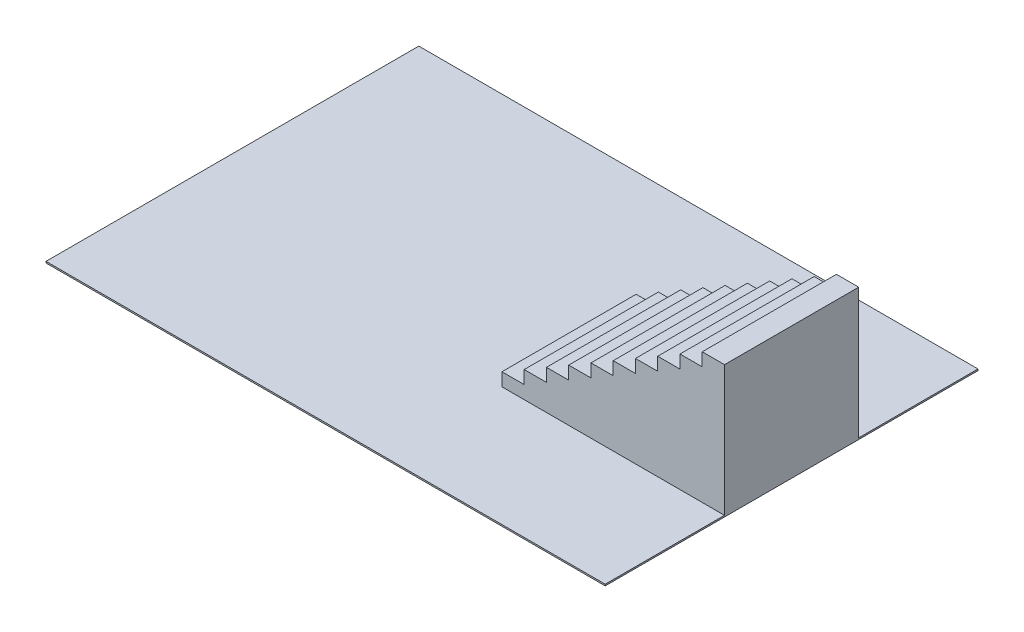
ISO-10303-21;
HEADER;
FILE_DESCRIPTION(('STEP AP214'),'2;1');
FILE_NAME('part.step','',(''),(''),'','','');
FILE_SCHEMA(('AUTOMOTIVE_DESIGN { 1 0 10303 214 1 1 1 1 }'));
ENDSEC;
DATA;
#1=APPLICATION_CONTEXT('core data for automotive mechanical design processes');
#2=APPLICATION_PROTOCOL_DEFINITION('international standard','automotive_design',2000,#1);
#3=PRODUCT_CONTEXT('',#1,'mechanical');
#4=PRODUCT('Part','Part','',(#3));
#5=PRODUCT_RELATED_PRODUCT_CATEGORY('part','',(#4));
#6=PRODUCT_DEFINITION_FORMATION('','',#4);
#7=PRODUCT_DEFINITION_CONTEXT('part definition',#1,'design');
#8=PRODUCT_DEFINITION('design','',#6,#7);
#9=PRODUCT_DEFINITION_SHAPE('','',#8);
#10=(LENGTH_UNIT() NAMED_UNIT(*) SI_UNIT(.MILLI.,.METRE.));
#11=(NAMED_UNIT(*) PLANE_ANGLE_UNIT() SI_UNIT($,.RADIAN.));
#12=(NAMED_UNIT(*) SI_UNIT($,.STERADIAN.) SOLID_ANGLE_UNIT());
#13=UNCERTAINTY_MEASURE_WITH_UNIT(LENGTH_MEASURE(1.E-05),#10,'distance_accuracy_value','');
#14=(GEOMETRIC_REPRESENTATION_CONTEXT(3) GLOBAL_UNCERTAINTY_ASSIGNED_CONTEXT((#13)) GLOBAL_UNIT_ASSIGNED_CONTEXT((#10,
#11,#12)) REPRESENTATION_CONTEXT('',''));
#15=CARTESIAN_POINT('',(0.,0.,0.));
#16=DIRECTION('',(0.,0.,1.));
#17=DIRECTION('',(1.,0.,0.));
#18=AXIS2_PLACEMENT_3D('',#15,#16,#17);
#19=CARTESIAN_POINT('',(-952.5,5.08,-635.));
#20=DIRECTION('',(1.,0.,0.));
#21=DIRECTION('',(0.,0.,-1.));
#22=AXIS2_PLACEMENT_3D('',#19,#20,#21);
#23=PLANE('',#22);
#24=DIRECTION('',(0.,0.,1.));
#25=VECTOR('',#24,1.);
#26=CARTESIAN_POINT('',(-952.5,0.,-635.));
#27=LINE('',#26,#25);
#28=CARTESIAN_POINT('',(-952.5,0.,-635.));
#29=VERTEX_POINT('',#28);
#30=CARTESIAN_POINT('',(-952.5,0.,635.));
#31=VERTEX_POINT('',#30);
#32=EDGE_CURVE('E244',#29,#31,#27,.T.);
#33=ORIENTED_EDGE('',*,*,#32,.T.);
#34=DIRECTION('',(0.,-1.,0.));
#35=VECTOR('',#34,1.);
#36=CARTESIAN_POINT('',(-952.5,5.08,635.));
#37=LINE('',#36,#35);
#38=CARTESIAN_POINT('',(-952.5,5.08,635.));
#39=VERTEX_POINT('',#38);
#40=EDGE_CURVE('E11',#39,#31,#37,.T.);
#41=ORIENTED_EDGE('',*,*,#40,.F.);
#42=DIRECTION('',(0.,0.,1.));
#43=VECTOR('',#42,1.);
#44=CARTESIAN_POINT('',(-952.5,5.08,-635.));
#45=LINE('',#44,#43);
#46=CARTESIAN_POINT('',(-952.5,5.08,-635.));
#47=VERTEX_POINT('',#46);
#48=EDGE_CURVE('E252',#47,#39,#45,.T.);
#49=ORIENTED_EDGE('',*,*,#48,.F.);
#50=DIRECTION('',(0.,-1.,0.));
#51=VECTOR('',#50,1.);
#52=CARTESIAN_POINT('',(-952.5,5.08,-635.));
#53=LINE('',#52,#51);
#54=EDGE_CURVE('E239',#47,#29,#53,.T.);
#55=ORIENTED_EDGE('',*,*,#54,.T.);
#56=EDGE_LOOP('',(#33,#41,#49,#55));
#57=FACE_BOUND('',#56,.T.);
#58=ADVANCED_FACE('F33',(#57),#23,.F.);
#59=CARTESIAN_POINT('',(952.5,5.08,635.));
#60=DIRECTION('',(0.,0.,-1.));
#61=DIRECTION('',(-1.,0.,0.));
#62=AXIS2_PLACEMENT_3D('',#59,#60,#61);
#63=PLANE('',#62);
#64=DIRECTION('',(1.,0.,0.));
#65=VECTOR('',#64,1.);
#66=CARTESIAN_POINT('',(952.5,0.,635.));
#67=LINE('',#66,#65);
#68=CARTESIAN_POINT('',(952.5,0.,635.));
#69=VERTEX_POINT('',#68);
#70=EDGE_CURVE('E247',#31,#69,#67,.T.);
#71=ORIENTED_EDGE('',*,*,#70,.T.);
#72=DIRECTION('',(0.,-1.,0.));
#73=VECTOR('',#72,1.);
#74=CARTESIAN_POINT('',(952.5,5.08,635.));
#75=LINE('',#74,#73);
#76=CARTESIAN_POINT('',(952.5,5.08,635.));
#77=VERTEX_POINT('',#76);
#78=EDGE_CURVE('E40',#77,#69,#75,.T.);
#79=ORIENTED_EDGE('',*,*,#78,.F.);
#80=DIRECTION('',(1.,0.,0.));
#81=VECTOR('',#80,1.);
#82=CARTESIAN_POINT('',(952.5,5.08,635.));
#83=LINE('',#82,#81);
#84=EDGE_CURVE('E84',#39,#77,#83,.T.);
#85=ORIENTED_EDGE('',*,*,#84,.F.);
#86=ORIENTED_EDGE('',*,*,#40,.T.);
#87=EDGE_LOOP('',(#71,#79,#85,#86));
#88=FACE_BOUND('',#87,.T.);
#89=ADVANCED_FACE('F511',(#88),#63,.F.);
#90=CARTESIAN_POINT('',(952.5,5.08,-635.));
#91=DIRECTION('',(-1.,0.,0.));
#92=DIRECTION('',(0.,0.,1.));
#93=AXIS2_PLACEMENT_3D('',#90,#91,#92);
#94=PLANE('',#93);
#95=DIRECTION('',(0.,0.,-1.));
#96=VECTOR('',#95,1.);
#97=CARTESIAN_POINT('',(952.5,0.,-635.));
#98=LINE('',#97,#96);
#99=CARTESIAN_POINT('',(952.5,0.,-635.));
#100=VERTEX_POINT('',#99);
#101=EDGE_CURVE('E249',#69,#100,#98,.T.);
#102=ORIENTED_EDGE('',*,*,#101,.T.);
#103=DIRECTION('',(0.,-1.,0.));
#104=VECTOR('',#103,1.);
#105=CARTESIAN_POINT('',(952.5,5.08,-635.));
#106=LINE('',#105,#104);
#107=CARTESIAN_POINT('',(952.5,5.08,-635.));
#108=VERTEX_POINT('',#107);
#109=EDGE_CURVE('E254',#108,#100,#106,.T.);
#110=ORIENTED_EDGE('',*,*,#109,.F.);
#111=DIRECTION('',(0.,0.,-1.));
#112=VECTOR('',#111,1.);
#113=CARTESIAN_POINT('',(952.5,5.08,-635.));
#114=LINE('',#113,#112);
#115=CARTESIAN_POINT('',(952.5,5.08,-228.6));
#116=VERTEX_POINT('',#115);
#117=EDGE_CURVE('E237',#116,#108,#114,.T.);
#118=ORIENTED_EDGE('',*,*,#117,.F.);
#119=DIRECTION('',(0.,1.,0.));
#120=VECTOR('',#119,1.);
#121=CARTESIAN_POINT('',(952.5,449.58,-228.6));
#122=LINE('',#121,#120);
#123=CARTESIAN_POINT('',(952.5,449.58,-228.6));
#124=VERTEX_POINT('',#123);
#125=EDGE_CURVE('E265',#116,#124,#122,.T.);
#126=ORIENTED_EDGE('',*,*,#125,.T.);
#127=DIRECTION('',(0.,0.,-1.));
#128=VECTOR('',#127,1.);
#129=CARTESIAN_POINT('',(952.5,449.58,228.6));
#130=LINE('',#129,#128);
#131=CARTESIAN_POINT('',(952.5,449.58,228.6));
#132=VERTEX_POINT('',#131);
#133=EDGE_CURVE('E222',#132,#124,#130,.T.);
#134=ORIENTED_EDGE('',*,*,#133,.F.);
#135=DIRECTION('',(0.,1.,0.));
#136=VECTOR('',#135,1.);
#137=CARTESIAN_POINT('',(952.5,449.58,228.6));
#138=LINE('',#137,#136);
#139=CARTESIAN_POINT('',(952.5,5.08,228.6));
#140=VERTEX_POINT('',#139);
#141=EDGE_CURVE('E215',#140,#132,#138,.T.);
#142=ORIENTED_EDGE('',*,*,#141,.F.);
#143=EDGE_CURVE('E220',#77,#140,#114,.T.);
#144=ORIENTED_EDGE('',*,*,#143,.F.);
#145=ORIENTED_EDGE('',*,*,#78,.T.);
#146=EDGE_LOOP('',(#102,#110,#118,#126,#134,#142,#144,#145));
#147=FACE_BOUND('',#146,.T.);
#148=ADVANCED_FACE('F217',(#147),#94,.F.);
#149=CARTESIAN_POINT('',(952.5,5.08,-635.));
#150=DIRECTION('',(0.,0.,1.));
#151=DIRECTION('',(1.,0.,0.));
#152=AXIS2_PLACEMENT_3D('',#149,#150,#151);
#153=PLANE('',#152);
#154=DIRECTION('',(-1.,0.,0.));
#155=VECTOR('',#154,1.);
#156=CARTESIAN_POINT('',(952.5,0.,-635.));
#157=LINE('',#156,#155);
#158=EDGE_CURVE('E77',#100,#29,#157,.T.);
#159=ORIENTED_EDGE('',*,*,#158,.T.);
#160=ORIENTED_EDGE('',*,*,#54,.F.);
#161=DIRECTION('',(-1.,0.,0.));
#162=VECTOR('',#161,1.);
#163=CARTESIAN_POINT('',(952.5,5.08,-635.));
#164=LINE('',#163,#162);
#165=EDGE_CURVE('E56',#108,#47,#164,.T.);
#166=ORIENTED_EDGE('',*,*,#165,.F.);
#167=ORIENTED_EDGE('',*,*,#109,.T.);
#168=EDGE_LOOP('',(#159,#160,#166,#167));
#169=FACE_BOUND('',#168,.T.);
#170=ADVANCED_FACE('F263',(#169),#153,.F.);
#171=CARTESIAN_POINT('',(0.,5.08,0.));
#172=DIRECTION('',(0.,-1.,0.));
#173=DIRECTION('',(0.,0.,-1.));
#174=AXIS2_PLACEMENT_3D('',#171,#172,#173);
#175=PLANE('',#174);
#176=DIRECTION('',(0.,0.,-1.));
#177=VECTOR('',#176,1.);
#178=CARTESIAN_POINT('',(194.31,5.07999999999997,228.6));
#179=LINE('',#178,#177);
#180=CARTESIAN_POINT('',(194.31,5.07999999999997,228.6));
#181=VERTEX_POINT('',#180);
#182=CARTESIAN_POINT('',(194.31,5.07999999999997,-228.6));
#183=VERTEX_POINT('',#182);
#184=EDGE_CURVE('E266',#181,#183,#179,.T.);
#185=ORIENTED_EDGE('',*,*,#184,.T.);
#186=DIRECTION('',(1.,0.,0.));
#187=VECTOR('',#186,1.);
#188=CARTESIAN_POINT('',(194.31,5.07999999999997,-228.6));
#189=LINE('',#188,#187);
#190=EDGE_CURVE('E47',#183,#116,#189,.T.);
#191=ORIENTED_EDGE('',*,*,#190,.T.);
#192=ORIENTED_EDGE('',*,*,#117,.T.);
#193=ORIENTED_EDGE('',*,*,#165,.T.);
#194=ORIENTED_EDGE('',*,*,#48,.T.);
#195=ORIENTED_EDGE('',*,*,#84,.T.);
#196=ORIENTED_EDGE('',*,*,#143,.T.);
#197=DIRECTION('',(1.,0.,0.));
#198=VECTOR('',#197,1.);
#199=CARTESIAN_POINT('',(194.31,5.07999999999997,228.6));
#200=LINE('',#199,#198);
#201=EDGE_CURVE('E226',#181,#140,#200,.T.);
#202=ORIENTED_EDGE('',*,*,#201,.F.);
#203=EDGE_LOOP('',(#185,#191,#192,#193,#194,#195,#196,#202));
#204=FACE_BOUND('',#203,.T.);
#205=ADVANCED_FACE('F236',(#204),#175,.F.);
#206=CARTESIAN_POINT('',(0.,0.,0.));
#207=DIRECTION('',(0.,-1.,0.));
#208=DIRECTION('',(0.,0.,-1.));
#209=AXIS2_PLACEMENT_3D('',#206,#207,#208);
#210=PLANE('',#209);
#211=ORIENTED_EDGE('',*,*,#32,.F.);
#212=ORIENTED_EDGE('',*,*,#158,.F.);
#213=ORIENTED_EDGE('',*,*,#101,.F.);
#214=ORIENTED_EDGE('',*,*,#70,.F.);
#215=EDGE_LOOP('',(#211,#212,#213,#214));
#216=FACE_BOUND('',#215,.T.);
#217=ADVANCED_FACE('F259',(#216),#210,.T.);
#218=CARTESIAN_POINT('',(876.681,449.58,228.6));
#219=DIRECTION('',(0.,-1.,0.));
#220=DIRECTION('',(1.,0.,0.));
#221=AXIS2_PLACEMENT_3D('',#218,#219,#220);
#222=PLANE('',#221);
#223=DIRECTION('',(-1.,0.,0.));
#224=VECTOR('',#223,1.);
#225=CARTESIAN_POINT('',(876.681,449.58,-228.6));
#226=LINE('',#225,#224);
#227=CARTESIAN_POINT('',(876.681,449.58,-228.6));
#228=VERTEX_POINT('',#227);
#229=EDGE_CURVE('E268',#124,#228,#226,.T.);
#230=ORIENTED_EDGE('',*,*,#229,.T.);
#231=DIRECTION('',(0.,0.,-1.));
#232=VECTOR('',#231,1.);
#233=CARTESIAN_POINT('',(876.681,449.58,228.6));
#234=LINE('',#233,#232);
#235=CARTESIAN_POINT('',(876.681,449.58,228.6));
#236=VERTEX_POINT('',#235);
#237=EDGE_CURVE('E366',#236,#228,#234,.T.);
#238=ORIENTED_EDGE('',*,*,#237,.F.);
#239=DIRECTION('',(-1.,0.,0.));
#240=VECTOR('',#239,1.);
#241=CARTESIAN_POINT('',(876.681,449.58,228.6));
#242=LINE('',#241,#240);
#243=EDGE_CURVE('E225',#132,#236,#242,.T.);
#244=ORIENTED_EDGE('',*,*,#243,.F.);
#245=ORIENTED_EDGE('',*,*,#133,.T.);
#246=EDGE_LOOP('',(#230,#238,#244,#245));
#247=FACE_BOUND('',#246,.T.);
#248=ADVANCED_FACE('F371',(#247),#222,.F.);
#249=CARTESIAN_POINT('',(876.681,405.13,228.6));
#250=DIRECTION('',(1.,0.,0.));
#251=DIRECTION('',(0.,0.,-1.));
#252=AXIS2_PLACEMENT_3D('',#249,#250,#251);
#253=PLANE('',#252);
#254=DIRECTION('',(0.,-1.,0.));
#255=VECTOR('',#254,1.);
#256=CARTESIAN_POINT('',(876.681,405.13,-228.6));
#257=LINE('',#256,#255);
#258=CARTESIAN_POINT('',(876.681,405.13,-228.6));
#259=VERTEX_POINT('',#258);
#260=EDGE_CURVE('E274',#228,#259,#257,.T.);
#261=ORIENTED_EDGE('',*,*,#260,.T.);
#262=DIRECTION('',(0.,0.,-1.));
#263=VECTOR('',#262,1.);
#264=CARTESIAN_POINT('',(876.681,405.13,228.6));
#265=LINE('',#264,#263);
#266=CARTESIAN_POINT('',(876.681,405.13,228.6));
#267=VERTEX_POINT('',#266);
#268=EDGE_CURVE('E363',#267,#259,#265,.T.);
#269=ORIENTED_EDGE('',*,*,#268,.F.);
#270=DIRECTION('',(0.,-1.,0.));
#271=VECTOR('',#270,1.);
#272=CARTESIAN_POINT('',(876.681,405.13,228.6));
#273=LINE('',#272,#271);
#274=EDGE_CURVE('E388',#236,#267,#273,.T.);
#275=ORIENTED_EDGE('',*,*,#274,.F.);
#276=ORIENTED_EDGE('',*,*,#237,.T.);
#277=EDGE_LOOP('',(#261,#269,#275,#276));
#278=FACE_BOUND('',#277,.T.);
#279=ADVANCED_FACE('F379',(#278),#253,.F.);
#280=CARTESIAN_POINT('',(800.862,405.13,228.6));
#281=DIRECTION('',(0.,-1.,0.));
#282=DIRECTION('',(1.,0.,0.));
#283=AXIS2_PLACEMENT_3D('',#280,#281,#282);
#284=PLANE('',#283);
#285=DIRECTION('',(-1.,0.,0.));
#286=VECTOR('',#285,1.);
#287=CARTESIAN_POINT('',(800.862,405.13,-228.6));
#288=LINE('',#287,#286);
#289=CARTESIAN_POINT('',(800.862,405.13,-228.6));
#290=VERTEX_POINT('',#289);
#291=EDGE_CURVE('E276',#259,#290,#288,.T.);
#292=ORIENTED_EDGE('',*,*,#291,.T.);
#293=DIRECTION('',(0.,0.,-1.));
#294=VECTOR('',#293,1.);
#295=CARTESIAN_POINT('',(800.862,405.13,228.6));
#296=LINE('',#295,#294);
#297=CARTESIAN_POINT('',(800.862,405.13,228.6));
#298=VERTEX_POINT('',#297);
#299=EDGE_CURVE('E360',#298,#290,#296,.T.);
#300=ORIENTED_EDGE('',*,*,#299,.F.);
#301=DIRECTION('',(-1.,0.,0.));
#302=VECTOR('',#301,1.);
#303=CARTESIAN_POINT('',(800.862,405.13,228.6));
#304=LINE('',#303,#302);
#305=EDGE_CURVE('E385',#267,#298,#304,.T.);
#306=ORIENTED_EDGE('',*,*,#305,.F.);
#307=ORIENTED_EDGE('',*,*,#268,.T.);
#308=EDGE_LOOP('',(#292,#300,#306,#307));
#309=FACE_BOUND('',#308,.T.);
#310=ADVANCED_FACE('F383',(#309),#284,.F.);
#311=CARTESIAN_POINT('',(800.862,360.68,228.6));
#312=DIRECTION('',(1.,0.,0.));
#313=DIRECTION('',(0.,0.,-1.));
#314=AXIS2_PLACEMENT_3D('',#311,#312,#313);
#315=PLANE('',#314);
#316=DIRECTION('',(0.,-1.,0.));
#317=VECTOR('',#316,1.);
#318=CARTESIAN_POINT('',(800.862,360.68,-228.6));
#319=LINE('',#318,#317);
#320=CARTESIAN_POINT('',(800.862,360.68,-228.6));
#321=VERTEX_POINT('',#320);
#322=EDGE_CURVE('E278',#290,#321,#319,.T.);
#323=ORIENTED_EDGE('',*,*,#322,.T.);
#324=DIRECTION('',(0.,0.,-1.));
#325=VECTOR('',#324,1.);
#326=CARTESIAN_POINT('',(800.862,360.68,228.6));
#327=LINE('',#326,#325);
#328=CARTESIAN_POINT('',(800.862,360.68,228.6));
#329=VERTEX_POINT('',#328);
#330=EDGE_CURVE('E357',#329,#321,#327,.T.);
#331=ORIENTED_EDGE('',*,*,#330,.F.);
#332=DIRECTION('',(0.,-1.,0.));
#333=VECTOR('',#332,1.);
#334=CARTESIAN_POINT('',(800.862,360.68,228.6));
#335=LINE('',#334,#333);
#336=EDGE_CURVE('E387',#298,#329,#335,.T.);
#337=ORIENTED_EDGE('',*,*,#336,.F.);
#338=ORIENTED_EDGE('',*,*,#299,.T.);
#339=EDGE_LOOP('',(#323,#331,#337,#338));
#340=FACE_BOUND('',#339,.T.);
#341=ADVANCED_FACE('F501',(#340),#315,.F.);
#342=CARTESIAN_POINT('',(725.043,360.680000000001,228.6));
#343=DIRECTION('',(0.,-1.,0.));
#344=DIRECTION('',(1.,0.,0.));
#345=AXIS2_PLACEMENT_3D('',#342,#343,#344);
#346=PLANE('',#345);
#347=DIRECTION('',(-1.,0.,0.));
#348=VECTOR('',#347,1.);
#349=CARTESIAN_POINT('',(725.043,360.680000000001,-228.6));
#350=LINE('',#349,#348);
#351=CARTESIAN_POINT('',(725.043,360.680000000001,-228.6));
#352=VERTEX_POINT('',#351);
#353=EDGE_CURVE('E280',#321,#352,#350,.T.);
#354=ORIENTED_EDGE('',*,*,#353,.T.);
#355=DIRECTION('',(0.,0.,-1.));
#356=VECTOR('',#355,1.);
#357=CARTESIAN_POINT('',(725.043,360.680000000001,228.6));
#358=LINE('',#357,#356);
#359=CARTESIAN_POINT('',(725.043,360.680000000001,228.6));
#360=VERTEX_POINT('',#359);
#361=EDGE_CURVE('E354',#360,#352,#358,.T.);
#362=ORIENTED_EDGE('',*,*,#361,.F.);
#363=DIRECTION('',(-1.,0.,0.));
#364=VECTOR('',#363,1.);
#365=CARTESIAN_POINT('',(725.043,360.680000000001,228.6));
#366=LINE('',#365,#364);
#367=EDGE_CURVE('E390',#329,#360,#366,.T.);
#368=ORIENTED_EDGE('',*,*,#367,.F.);
#369=ORIENTED_EDGE('',*,*,#330,.T.);
#370=EDGE_LOOP('',(#354,#362,#368,#369));
#371=FACE_BOUND('',#370,.T.);
#372=ADVANCED_FACE('F498',(#371),#346,.F.);
#373=CARTESIAN_POINT('',(725.043,316.230000000001,228.6));
#374=DIRECTION('',(1.,0.,0.));
#375=DIRECTION('',(0.,1.,0.));
#376=AXIS2_PLACEMENT_3D('',#373,#374,#375);
#377=PLANE('',#376);
#378=DIRECTION('',(0.,-1.,0.));
#379=VECTOR('',#378,1.);
#380=CARTESIAN_POINT('',(725.043,316.230000000001,-228.6));
#381=LINE('',#380,#379);
#382=CARTESIAN_POINT('',(725.043,316.230000000001,-228.6));
#383=VERTEX_POINT('',#382);
#384=EDGE_CURVE('E282',#352,#383,#381,.T.);
#385=ORIENTED_EDGE('',*,*,#384,.T.);
#386=DIRECTION('',(0.,0.,-1.));
#387=VECTOR('',#386,1.);
#388=CARTESIAN_POINT('',(725.043,316.230000000001,228.6));
#389=LINE('',#388,#387);
#390=CARTESIAN_POINT('',(725.043,316.230000000001,228.6));
#391=VERTEX_POINT('',#390);
#392=EDGE_CURVE('E351',#391,#383,#389,.T.);
#393=ORIENTED_EDGE('',*,*,#392,.F.);
#394=DIRECTION('',(0.,-1.,0.));
#395=VECTOR('',#394,1.);
#396=CARTESIAN_POINT('',(725.043,316.230000000001,228.6));
#397=LINE('',#396,#395);
#398=EDGE_CURVE('E396',#360,#391,#397,.T.);
#399=ORIENTED_EDGE('',*,*,#398,.F.);
#400=ORIENTED_EDGE('',*,*,#361,.T.);
#401=EDGE_LOOP('',(#385,#393,#399,#400));
#402=FACE_BOUND('',#401,.T.);
#403=ADVANCED_FACE('F493',(#402),#377,.F.);
#404=CARTESIAN_POINT('',(649.224,316.230000000001,228.6));
#405=DIRECTION('',(0.,-1.,0.));
#406=DIRECTION('',(1.,0.,0.));
#407=AXIS2_PLACEMENT_3D('',#404,#405,#406);
#408=PLANE('',#407);
#409=DIRECTION('',(-1.,0.,0.));
#410=VECTOR('',#409,1.);
#411=CARTESIAN_POINT('',(649.224,316.230000000001,-228.6));
#412=LINE('',#411,#410);
#413=CARTESIAN_POINT('',(649.224,316.230000000001,-228.6));
#414=VERTEX_POINT('',#413);
#415=EDGE_CURVE('E284',#383,#414,#412,.T.);
#416=ORIENTED_EDGE('',*,*,#415,.T.);
#417=DIRECTION('',(0.,0.,-1.));
#418=VECTOR('',#417,1.);
#419=CARTESIAN_POINT('',(649.224,316.230000000001,228.6));
#420=LINE('',#419,#418);
#421=CARTESIAN_POINT('',(649.224,316.230000000001,228.6));
#422=VERTEX_POINT('',#421);
#423=EDGE_CURVE('E348',#422,#414,#420,.T.);
#424=ORIENTED_EDGE('',*,*,#423,.F.);
#425=DIRECTION('',(-1.,0.,0.));
#426=VECTOR('',#425,1.);
#427=CARTESIAN_POINT('',(649.224,316.230000000001,228.6));
#428=LINE('',#427,#426);
#429=EDGE_CURVE('E398',#391,#422,#428,.T.);
#430=ORIENTED_EDGE('',*,*,#429,.F.);
#431=ORIENTED_EDGE('',*,*,#392,.T.);
#432=EDGE_LOOP('',(#416,#424,#430,#431));
#433=FACE_BOUND('',#432,.T.);
#434=ADVANCED_FACE('F488',(#433),#408,.F.);
#435=CARTESIAN_POINT('',(649.224,271.780000000001,228.6));
#436=DIRECTION('',(1.,0.,0.));
#437=DIRECTION('',(0.,1.,0.));
#438=AXIS2_PLACEMENT_3D('',#435,#436,#437);
#439=PLANE('',#438);
#440=DIRECTION('',(0.,-1.,0.));
#441=VECTOR('',#440,1.);
#442=CARTESIAN_POINT('',(649.224,271.780000000001,-228.6));
#443=LINE('',#442,#441);
#444=CARTESIAN_POINT('',(649.224,271.780000000001,-228.6));
#445=VERTEX_POINT('',#444);
#446=EDGE_CURVE('E286',#414,#445,#443,.T.);
#447=ORIENTED_EDGE('',*,*,#446,.T.);
#448=DIRECTION('',(0.,0.,-1.));
#449=VECTOR('',#448,1.);
#450=CARTESIAN_POINT('',(649.224,271.780000000001,228.6));
#451=LINE('',#450,#449);
#452=CARTESIAN_POINT('',(649.224,271.780000000001,228.6));
#453=VERTEX_POINT('',#452);
#454=EDGE_CURVE('E345',#453,#445,#451,.T.);
#455=ORIENTED_EDGE('',*,*,#454,.F.);
#456=DIRECTION('',(0.,-1.,0.));
#457=VECTOR('',#456,1.);
#458=CARTESIAN_POINT('',(649.224,271.780000000001,228.6));
#459=LINE('',#458,#457);
#460=EDGE_CURVE('E400',#422,#453,#459,.T.);
#461=ORIENTED_EDGE('',*,*,#460,.F.);
#462=ORIENTED_EDGE('',*,*,#423,.T.);
#463=EDGE_LOOP('',(#447,#455,#461,#462));
#464=FACE_BOUND('',#463,.T.);
#465=ADVANCED_FACE('F484',(#464),#439,.F.);
#466=CARTESIAN_POINT('',(573.405,271.780000000001,228.6));
#467=DIRECTION('',(0.,-1.,0.));
#468=DIRECTION('',(1.,0.,0.));
#469=AXIS2_PLACEMENT_3D('',#466,#467,#468);
#470=PLANE('',#469);
#471=DIRECTION('',(-1.,0.,0.));
#472=VECTOR('',#471,1.);
#473=CARTESIAN_POINT('',(573.405,271.780000000001,-228.6));
#474=LINE('',#473,#472);
#475=CARTESIAN_POINT('',(573.405,271.780000000001,-228.6));
#476=VERTEX_POINT('',#475);
#477=EDGE_CURVE('E288',#445,#476,#474,.T.);
#478=ORIENTED_EDGE('',*,*,#477,.T.);
#479=DIRECTION('',(0.,0.,-1.));
#480=VECTOR('',#479,1.);
#481=CARTESIAN_POINT('',(573.405,271.780000000001,228.6));
#482=LINE('',#481,#480);
#483=CARTESIAN_POINT('',(573.405,271.780000000001,228.6));
#484=VERTEX_POINT('',#483);
#485=EDGE_CURVE('E342',#484,#476,#482,.T.);
#486=ORIENTED_EDGE('',*,*,#485,.F.);
#487=DIRECTION('',(-1.,0.,0.));
#488=VECTOR('',#487,1.);
#489=CARTESIAN_POINT('',(573.405,271.780000000001,228.6));
#490=LINE('',#489,#488);
#491=EDGE_CURVE('E402',#453,#484,#490,.T.);
#492=ORIENTED_EDGE('',*,*,#491,.F.);
#493=ORIENTED_EDGE('',*,*,#454,.T.);
#494=EDGE_LOOP('',(#478,#486,#492,#493));
#495=FACE_BOUND('',#494,.T.);
#496=ADVANCED_FACE('F479',(#495),#470,.F.);
#497=CARTESIAN_POINT('',(573.405,227.330000000001,228.6));
#498=DIRECTION('',(1.,0.,0.));
#499=DIRECTION('',(0.,1.,0.));
#500=AXIS2_PLACEMENT_3D('',#497,#498,#499);
#501=PLANE('',#500);
#502=DIRECTION('',(0.,-1.,0.));
#503=VECTOR('',#502,1.);
#504=CARTESIAN_POINT('',(573.405,227.330000000001,-228.6));
#505=LINE('',#504,#503);
#506=CARTESIAN_POINT('',(573.405,227.330000000001,-228.6));
#507=VERTEX_POINT('',#506);
#508=EDGE_CURVE('E290',#476,#507,#505,.T.);
#509=ORIENTED_EDGE('',*,*,#508,.T.);
#510=DIRECTION('',(0.,0.,-1.));
#511=VECTOR('',#510,1.);
#512=CARTESIAN_POINT('',(573.405,227.330000000001,228.6));
#513=LINE('',#512,#511);
#514=CARTESIAN_POINT('',(573.405,227.330000000001,228.6));
#515=VERTEX_POINT('',#514);
#516=EDGE_CURVE('E339',#515,#507,#513,.T.);
#517=ORIENTED_EDGE('',*,*,#516,.F.);
#518=DIRECTION('',(0.,-1.,0.));
#519=VECTOR('',#518,1.);
#520=CARTESIAN_POINT('',(573.405,227.330000000001,228.6));
#521=LINE('',#520,#519);
#522=EDGE_CURVE('E404',#484,#515,#521,.T.);
#523=ORIENTED_EDGE('',*,*,#522,.F.);
#524=ORIENTED_EDGE('',*,*,#485,.T.);
#525=EDGE_LOOP('',(#509,#517,#523,#524));
#526=FACE_BOUND('',#525,.T.);
#527=ADVANCED_FACE('F473',(#526),#501,.F.);
#528=CARTESIAN_POINT('',(497.586,227.330000000001,228.6));
#529=DIRECTION('',(0.,-1.,0.));
#530=DIRECTION('',(1.,0.,0.));
#531=AXIS2_PLACEMENT_3D('',#528,#529,#530);
#532=PLANE('',#531);
#533=DIRECTION('',(-1.,0.,0.));
#534=VECTOR('',#533,1.);
#535=CARTESIAN_POINT('',(497.586,227.330000000001,-228.6));
#536=LINE('',#535,#534);
#537=CARTESIAN_POINT('',(497.586,227.330000000001,-228.6));
#538=VERTEX_POINT('',#537);
#539=EDGE_CURVE('E292',#507,#538,#536,.T.);
#540=ORIENTED_EDGE('',*,*,#539,.T.);
#541=DIRECTION('',(0.,0.,-1.));
#542=VECTOR('',#541,1.);
#543=CARTESIAN_POINT('',(497.586,227.330000000001,228.6));
#544=LINE('',#543,#542);
#545=CARTESIAN_POINT('',(497.586,227.330000000001,228.6));
#546=VERTEX_POINT('',#545);
#547=EDGE_CURVE('E336',#546,#538,#544,.T.);
#548=ORIENTED_EDGE('',*,*,#547,.F.);
#549=DIRECTION('',(-1.,0.,0.));
#550=VECTOR('',#549,1.);
#551=CARTESIAN_POINT('',(497.586,227.330000000001,228.6));
#552=LINE('',#551,#550);
#553=EDGE_CURVE('E406',#515,#546,#552,.T.);
#554=ORIENTED_EDGE('',*,*,#553,.F.);
#555=ORIENTED_EDGE('',*,*,#516,.T.);
#556=EDGE_LOOP('',(#540,#548,#554,#555));
#557=FACE_BOUND('',#556,.T.);
#558=ADVANCED_FACE('F469',(#557),#532,.F.);
#559=CARTESIAN_POINT('',(497.586,182.880000000001,228.6));
#560=DIRECTION('',(1.,0.,0.));
#561=DIRECTION('',(0.,1.,0.));
#562=AXIS2_PLACEMENT_3D('',#559,#560,#561);
#563=PLANE('',#562);
#564=DIRECTION('',(0.,-1.,0.));
#565=VECTOR('',#564,1.);
#566=CARTESIAN_POINT('',(497.586,182.880000000001,-228.6));
#567=LINE('',#566,#565);
#568=CARTESIAN_POINT('',(497.586,182.880000000001,-228.6));
#569=VERTEX_POINT('',#568);
#570=EDGE_CURVE('E294',#538,#569,#567,.T.);
#571=ORIENTED_EDGE('',*,*,#570,.T.);
#572=DIRECTION('',(0.,0.,-1.));
#573=VECTOR('',#572,1.);
#574=CARTESIAN_POINT('',(497.586,182.880000000001,228.6));
#575=LINE('',#574,#573);
#576=CARTESIAN_POINT('',(497.586,182.880000000001,228.6));
#577=VERTEX_POINT('',#576);
#578=EDGE_CURVE('E333',#577,#569,#575,.T.);
#579=ORIENTED_EDGE('',*,*,#578,.F.);
#580=DIRECTION('',(0.,-1.,0.));
#581=VECTOR('',#580,1.);
#582=CARTESIAN_POINT('',(497.586,182.880000000001,228.6));
#583=LINE('',#582,#581);
#584=EDGE_CURVE('E408',#546,#577,#583,.T.);
#585=ORIENTED_EDGE('',*,*,#584,.F.);
#586=ORIENTED_EDGE('',*,*,#547,.T.);
#587=EDGE_LOOP('',(#571,#579,#585,#586));
#588=FACE_BOUND('',#587,.T.);
#589=ADVANCED_FACE('F464',(#588),#563,.F.);
#590=CARTESIAN_POINT('',(421.767,182.880000000001,228.6));
#591=DIRECTION('',(0.,-1.,0.));
#592=DIRECTION('',(1.,0.,0.));
#593=AXIS2_PLACEMENT_3D('',#590,#591,#592);
#594=PLANE('',#593);
#595=DIRECTION('',(-1.,0.,0.));
#596=VECTOR('',#595,1.);
#597=CARTESIAN_POINT('',(421.767,182.880000000001,-228.6));
#598=LINE('',#597,#596);
#599=CARTESIAN_POINT('',(421.767,182.880000000001,-228.6));
#600=VERTEX_POINT('',#599);
#601=EDGE_CURVE('E296',#569,#600,#598,.T.);
#602=ORIENTED_EDGE('',*,*,#601,.T.);
#603=DIRECTION('',(0.,0.,-1.));
#604=VECTOR('',#603,1.);
#605=CARTESIAN_POINT('',(421.767,182.880000000001,228.6));
#606=LINE('',#605,#604);
#607=CARTESIAN_POINT('',(421.767,182.880000000001,228.6));
#608=VERTEX_POINT('',#607);
#609=EDGE_CURVE('E330',#608,#600,#606,.T.);
#610=ORIENTED_EDGE('',*,*,#609,.F.);
#611=DIRECTION('',(-1.,0.,0.));
#612=VECTOR('',#611,1.);
#613=CARTESIAN_POINT('',(421.767,182.880000000001,228.6));
#614=LINE('',#613,#612);
#615=EDGE_CURVE('E410',#577,#608,#614,.T.);
#616=ORIENTED_EDGE('',*,*,#615,.F.);
#617=ORIENTED_EDGE('',*,*,#578,.T.);
#618=EDGE_LOOP('',(#602,#610,#616,#617));
#619=FACE_BOUND('',#618,.T.);
#620=ADVANCED_FACE('F458',(#619),#594,.F.);
#621=CARTESIAN_POINT('',(421.767,138.430000000001,228.6));
#622=DIRECTION('',(1.,0.,0.));
#623=DIRECTION('',(0.,1.,0.));
#624=AXIS2_PLACEMENT_3D('',#621,#622,#623);
#625=PLANE('',#624);
#626=DIRECTION('',(0.,-1.,0.));
#627=VECTOR('',#626,1.);
#628=CARTESIAN_POINT('',(421.767,138.430000000001,-228.6));
#629=LINE('',#628,#627);
#630=CARTESIAN_POINT('',(421.767,138.430000000001,-228.6));
#631=VERTEX_POINT('',#630);
#632=EDGE_CURVE('E298',#600,#631,#629,.T.);
#633=ORIENTED_EDGE('',*,*,#632,.T.);
#634=DIRECTION('',(0.,0.,-1.));
#635=VECTOR('',#634,1.);
#636=CARTESIAN_POINT('',(421.767,138.430000000001,228.6));
#637=LINE('',#636,#635);
#638=CARTESIAN_POINT('',(421.767,138.430000000001,228.6));
#639=VERTEX_POINT('',#638);
#640=EDGE_CURVE('E327',#639,#631,#637,.T.);
#641=ORIENTED_EDGE('',*,*,#640,.F.);
#642=DIRECTION('',(0.,-1.,0.));
#643=VECTOR('',#642,1.);
#644=CARTESIAN_POINT('',(421.767,138.430000000001,228.6));
#645=LINE('',#644,#643);
#646=EDGE_CURVE('E412',#608,#639,#645,.T.);
#647=ORIENTED_EDGE('',*,*,#646,.F.);
#648=ORIENTED_EDGE('',*,*,#609,.T.);
#649=EDGE_LOOP('',(#633,#641,#647,#648));
#650=FACE_BOUND('',#649,.T.);
#651=ADVANCED_FACE('F454',(#650),#625,.F.);
#652=CARTESIAN_POINT('',(345.948,138.430000000001,228.6));
#653=DIRECTION('',(0.,-1.,0.));
#654=DIRECTION('',(1.,0.,0.));
#655=AXIS2_PLACEMENT_3D('',#652,#653,#654);
#656=PLANE('',#655);
#657=DIRECTION('',(-1.,0.,0.));
#658=VECTOR('',#657,1.);
#659=CARTESIAN_POINT('',(345.948,138.430000000001,-228.6));
#660=LINE('',#659,#658);
#661=CARTESIAN_POINT('',(345.948,138.430000000001,-228.6));
#662=VERTEX_POINT('',#661);
#663=EDGE_CURVE('E300',#631,#662,#660,.T.);
#664=ORIENTED_EDGE('',*,*,#663,.T.);
#665=DIRECTION('',(0.,0.,-1.));
#666=VECTOR('',#665,1.);
#667=CARTESIAN_POINT('',(345.948,138.430000000001,228.6));
#668=LINE('',#667,#666);
#669=CARTESIAN_POINT('',(345.948,138.430000000001,228.6));
#670=VERTEX_POINT('',#669);
#671=EDGE_CURVE('E324',#670,#662,#668,.T.);
#672=ORIENTED_EDGE('',*,*,#671,.F.);
#673=DIRECTION('',(-1.,0.,0.));
#674=VECTOR('',#673,1.);
#675=CARTESIAN_POINT('',(345.948,138.430000000001,228.6));
#676=LINE('',#675,#674);
#677=EDGE_CURVE('E414',#639,#670,#676,.T.);
#678=ORIENTED_EDGE('',*,*,#677,.F.);
#679=ORIENTED_EDGE('',*,*,#640,.T.);
#680=EDGE_LOOP('',(#664,#672,#678,#679));
#681=FACE_BOUND('',#680,.T.);
#682=ADVANCED_FACE('F449',(#681),#656,.F.);
#683=CARTESIAN_POINT('',(345.948,93.9800000000011,228.6));
#684=DIRECTION('',(1.,0.,0.));
#685=DIRECTION('',(0.,1.,0.));
#686=AXIS2_PLACEMENT_3D('',#683,#684,#685);
#687=PLANE('',#686);
#688=DIRECTION('',(0.,-1.,0.));
#689=VECTOR('',#688,1.);
#690=CARTESIAN_POINT('',(345.948,93.9800000000011,-228.6));
#691=LINE('',#690,#689);
#692=CARTESIAN_POINT('',(345.948,93.9800000000011,-228.6));
#693=VERTEX_POINT('',#692);
#694=EDGE_CURVE('E302',#662,#693,#691,.T.);
#695=ORIENTED_EDGE('',*,*,#694,.T.);
#696=DIRECTION('',(0.,0.,-1.));
#697=VECTOR('',#696,1.);
#698=CARTESIAN_POINT('',(345.948,93.9800000000011,228.6));
#699=LINE('',#698,#697);
#700=CARTESIAN_POINT('',(345.948,93.9800000000011,228.6));
#701=VERTEX_POINT('',#700);
#702=EDGE_CURVE('E321',#701,#693,#699,.T.);
#703=ORIENTED_EDGE('',*,*,#702,.F.);
#704=DIRECTION('',(0.,-1.,0.));
#705=VECTOR('',#704,1.);
#706=CARTESIAN_POINT('',(345.948,93.9800000000011,228.6));
#707=LINE('',#706,#705);
#708=EDGE_CURVE('E416',#670,#701,#707,.T.);
#709=ORIENTED_EDGE('',*,*,#708,.F.);
#710=ORIENTED_EDGE('',*,*,#671,.T.);
#711=EDGE_LOOP('',(#695,#703,#709,#710));
#712=FACE_BOUND('',#711,.T.);
#713=ADVANCED_FACE('F443',(#712),#687,.F.);
#714=CARTESIAN_POINT('',(270.129,93.9800000000011,228.6));
#715=DIRECTION('',(0.,-1.,0.));
#716=DIRECTION('',(1.,0.,0.));
#717=AXIS2_PLACEMENT_3D('',#714,#715,#716);
#718=PLANE('',#717);
#719=DIRECTION('',(-1.,0.,0.));
#720=VECTOR('',#719,1.);
#721=CARTESIAN_POINT('',(270.129,93.9800000000011,-228.6));
#722=LINE('',#721,#720);
#723=CARTESIAN_POINT('',(270.129,93.9800000000011,-228.6));
#724=VERTEX_POINT('',#723);
#725=EDGE_CURVE('E304',#693,#724,#722,.T.);
#726=ORIENTED_EDGE('',*,*,#725,.T.);
#727=DIRECTION('',(0.,0.,-1.));
#728=VECTOR('',#727,1.);
#729=CARTESIAN_POINT('',(270.129,93.9800000000011,228.6));
#730=LINE('',#729,#728);
#731=CARTESIAN_POINT('',(270.129,93.9800000000011,228.6));
#732=VERTEX_POINT('',#731);
#733=EDGE_CURVE('E318',#732,#724,#730,.T.);
#734=ORIENTED_EDGE('',*,*,#733,.F.);
#735=DIRECTION('',(-1.,0.,0.));
#736=VECTOR('',#735,1.);
#737=CARTESIAN_POINT('',(270.129,93.9800000000011,228.6));
#738=LINE('',#737,#736);
#739=EDGE_CURVE('E418',#701,#732,#738,.T.);
#740=ORIENTED_EDGE('',*,*,#739,.F.);
#741=ORIENTED_EDGE('',*,*,#702,.T.);
#742=EDGE_LOOP('',(#726,#734,#740,#741));
#743=FACE_BOUND('',#742,.T.);
#744=ADVANCED_FACE('F439',(#743),#718,.F.);
#745=CARTESIAN_POINT('',(270.129,49.5299999999999,228.6));
#746=DIRECTION('',(1.,0.,0.));
#747=DIRECTION('',(0.,0.,-1.));
#748=AXIS2_PLACEMENT_3D('',#745,#746,#747);
#749=PLANE('',#748);
#750=DIRECTION('',(0.,-1.,0.));
#751=VECTOR('',#750,1.);
#752=CARTESIAN_POINT('',(270.129,49.5299999999999,-228.6));
#753=LINE('',#752,#751);
#754=CARTESIAN_POINT('',(270.129,49.5299999999999,-228.6));
#755=VERTEX_POINT('',#754);
#756=EDGE_CURVE('E306',#724,#755,#753,.T.);
#757=ORIENTED_EDGE('',*,*,#756,.T.);
#758=DIRECTION('',(0.,0.,-1.));
#759=VECTOR('',#758,1.);
#760=CARTESIAN_POINT('',(270.129,49.5299999999999,228.6));
#761=LINE('',#760,#759);
#762=CARTESIAN_POINT('',(270.129,49.5299999999999,228.6));
#763=VERTEX_POINT('',#762);
#764=EDGE_CURVE('E315',#763,#755,#761,.T.);
#765=ORIENTED_EDGE('',*,*,#764,.F.);
#766=DIRECTION('',(0.,-1.,0.));
#767=VECTOR('',#766,1.);
#768=CARTESIAN_POINT('',(270.129,49.5299999999999,228.6));
#769=LINE('',#768,#767);
#770=EDGE_CURVE('E420',#732,#763,#769,.T.);
#771=ORIENTED_EDGE('',*,*,#770,.F.);
#772=ORIENTED_EDGE('',*,*,#733,.T.);
#773=EDGE_LOOP('',(#757,#765,#771,#772));
#774=FACE_BOUND('',#773,.T.);
#775=ADVANCED_FACE('F435',(#774),#749,.F.);
#776=CARTESIAN_POINT('',(194.31,49.53,228.6));
#777=DIRECTION('',(0.,-1.,0.));
#778=DIRECTION('',(1.,0.,0.));
#779=AXIS2_PLACEMENT_3D('',#776,#777,#778);
#780=PLANE('',#779);
#781=DIRECTION('',(-1.,0.,0.));
#782=VECTOR('',#781,1.);
#783=CARTESIAN_POINT('',(194.31,49.53,-228.6));
#784=LINE('',#783,#782);
#785=CARTESIAN_POINT('',(194.31,49.53,-228.6));
#786=VERTEX_POINT('',#785);
#787=EDGE_CURVE('E308',#755,#786,#784,.T.);
#788=ORIENTED_EDGE('',*,*,#787,.T.);
#789=DIRECTION('',(0.,0.,-1.));
#790=VECTOR('',#789,1.);
#791=CARTESIAN_POINT('',(194.31,49.53,228.6));
#792=LINE('',#791,#790);
#793=CARTESIAN_POINT('',(194.31,49.53,228.6));
#794=VERTEX_POINT('',#793);
#795=EDGE_CURVE('E312',#794,#786,#792,.T.);
#796=ORIENTED_EDGE('',*,*,#795,.F.);
#797=DIRECTION('',(-1.,0.,0.));
#798=VECTOR('',#797,1.);
#799=CARTESIAN_POINT('',(194.31,49.53,228.6));
#800=LINE('',#799,#798);
#801=EDGE_CURVE('E421',#763,#794,#800,.T.);
#802=ORIENTED_EDGE('',*,*,#801,.F.);
#803=ORIENTED_EDGE('',*,*,#764,.T.);
#804=EDGE_LOOP('',(#788,#796,#802,#803));
#805=FACE_BOUND('',#804,.T.);
#806=ADVANCED_FACE('F427',(#805),#780,.F.);
#807=CARTESIAN_POINT('',(194.31,5.07999999999997,228.6));
#808=DIRECTION('',(1.,0.,0.));
#809=DIRECTION('',(0.,1.,0.));
#810=AXIS2_PLACEMENT_3D('',#807,#808,#809);
#811=PLANE('',#810);
#812=DIRECTION('',(0.,-1.,0.));
#813=VECTOR('',#812,1.);
#814=CARTESIAN_POINT('',(194.31,5.07999999999997,-228.6));
#815=LINE('',#814,#813);
#816=EDGE_CURVE('E234',#786,#183,#815,.T.);
#817=ORIENTED_EDGE('',*,*,#816,.T.);
#818=ORIENTED_EDGE('',*,*,#184,.F.);
#819=DIRECTION('',(0.,-1.,0.));
#820=VECTOR('',#819,1.);
#821=CARTESIAN_POINT('',(194.31,5.07999999999997,228.6));
#822=LINE('',#821,#820);
#823=EDGE_CURVE('E231',#794,#181,#822,.T.);
#824=ORIENTED_EDGE('',*,*,#823,.F.);
#825=ORIENTED_EDGE('',*,*,#795,.T.);
#826=EDGE_LOOP('',(#817,#818,#824,#825));
#827=FACE_BOUND('',#826,.T.);
#828=ADVANCED_FACE('F430',(#827),#811,.F.);
#829=CARTESIAN_POINT('',(0.,0.,228.6));
#830=DIRECTION('',(0.,0.,-1.));
#831=DIRECTION('',(-1.,0.,0.));
#832=AXIS2_PLACEMENT_3D('',#829,#830,#831);
#833=PLANE('',#832);
#834=ORIENTED_EDGE('',*,*,#201,.T.);
#835=ORIENTED_EDGE('',*,*,#141,.T.);
#836=ORIENTED_EDGE('',*,*,#243,.T.);
#837=ORIENTED_EDGE('',*,*,#274,.T.);
#838=ORIENTED_EDGE('',*,*,#305,.T.);
#839=ORIENTED_EDGE('',*,*,#336,.T.);
#840=ORIENTED_EDGE('',*,*,#367,.T.);
#841=ORIENTED_EDGE('',*,*,#398,.T.);
#842=ORIENTED_EDGE('',*,*,#429,.T.);
#843=ORIENTED_EDGE('',*,*,#460,.T.);
#844=ORIENTED_EDGE('',*,*,#491,.T.);
#845=ORIENTED_EDGE('',*,*,#522,.T.);
#846=ORIENTED_EDGE('',*,*,#553,.T.);
#847=ORIENTED_EDGE('',*,*,#584,.T.);
#848=ORIENTED_EDGE('',*,*,#615,.T.);
#849=ORIENTED_EDGE('',*,*,#646,.T.);
#850=ORIENTED_EDGE('',*,*,#677,.T.);
#851=ORIENTED_EDGE('',*,*,#708,.T.);
#852=ORIENTED_EDGE('',*,*,#739,.T.);
#853=ORIENTED_EDGE('',*,*,#770,.T.);
#854=ORIENTED_EDGE('',*,*,#801,.T.);
#855=ORIENTED_EDGE('',*,*,#823,.T.);
#856=EDGE_LOOP('',(#834,#835,#836,#837,#838,#839,#840,#841,#842,#843,#844,#845,#846,#847,#848,
#849,#850,#851,#852,#853,#854,#855));
#857=FACE_BOUND('',#856,.T.);
#858=ADVANCED_FACE('F229',(#857),#833,.F.);
#859=CARTESIAN_POINT('',(0.,0.,-228.6));
#860=DIRECTION('',(0.,0.,-1.));
#861=DIRECTION('',(-1.,0.,0.));
#862=AXIS2_PLACEMENT_3D('',#859,#860,#861);
#863=PLANE('',#862);
#864=ORIENTED_EDGE('',*,*,#190,.F.);
#865=ORIENTED_EDGE('',*,*,#816,.F.);
#866=ORIENTED_EDGE('',*,*,#787,.F.);
#867=ORIENTED_EDGE('',*,*,#756,.F.);
#868=ORIENTED_EDGE('',*,*,#725,.F.);
#869=ORIENTED_EDGE('',*,*,#694,.F.);
#870=ORIENTED_EDGE('',*,*,#663,.F.);
#871=ORIENTED_EDGE('',*,*,#632,.F.);
#872=ORIENTED_EDGE('',*,*,#601,.F.);
#873=ORIENTED_EDGE('',*,*,#570,.F.);
#874=ORIENTED_EDGE('',*,*,#539,.F.);
#875=ORIENTED_EDGE('',*,*,#508,.F.);
#876=ORIENTED_EDGE('',*,*,#477,.F.);
#877=ORIENTED_EDGE('',*,*,#446,.F.);
#878=ORIENTED_EDGE('',*,*,#415,.F.);
#879=ORIENTED_EDGE('',*,*,#384,.F.);
#880=ORIENTED_EDGE('',*,*,#353,.F.);
#881=ORIENTED_EDGE('',*,*,#322,.F.);
#882=ORIENTED_EDGE('',*,*,#291,.F.);
#883=ORIENTED_EDGE('',*,*,#260,.F.);
#884=ORIENTED_EDGE('',*,*,#229,.F.);
#885=ORIENTED_EDGE('',*,*,#125,.F.);
#886=EDGE_LOOP('',(#864,#865,#866,#867,#868,#869,#870,#871,#872,#873,#874,#875,#876,#877,#878,
#879,#880,#881,#882,#883,#884,#885));
#887=FACE_BOUND('',#886,.T.);
#888=ADVANCED_FACE('F374',(#887),#863,.T.);
#889=CLOSED_SHELL('',(#58,#89,#148,#170,#205,#217,#248,#279,#310,#341,#372,#403,#434,#465,#496,
#527,#558,#589,#620,#651,#682,#713,#744,#775,#806,#828,#858,#888));
#890=MANIFOLD_SOLID_BREP('B2',#889);
#891=ADVANCED_BREP_SHAPE_REPRESENTATION('',(#18,#890),#14);
#892=SHAPE_DEFINITION_REPRESENTATION(#9,#891);
ENDSEC;
END-ISO-10303-21;
